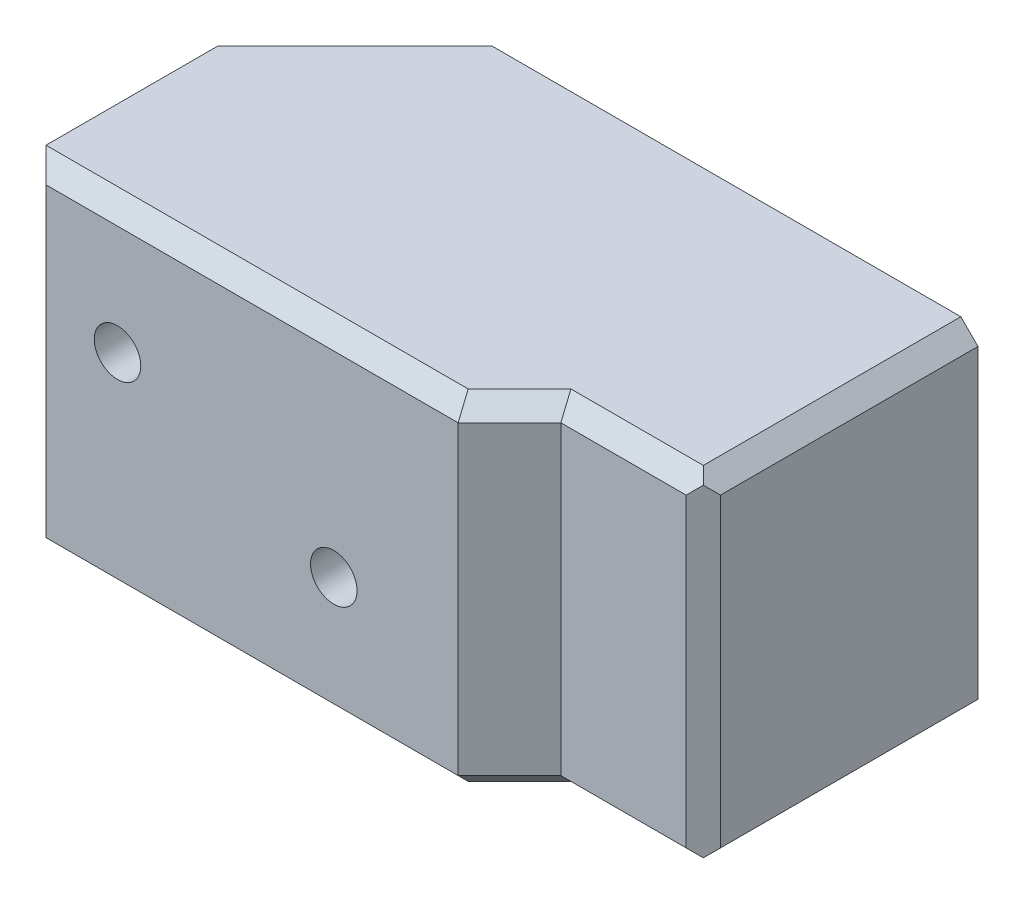
ISO-10303-21;
HEADER;
FILE_DESCRIPTION(('STEP AP214'),'2;1');
FILE_NAME('part.step','',(''),(''),'','','');
FILE_SCHEMA(('AUTOMOTIVE_DESIGN { 1 0 10303 214 1 1 1 1 }'));
ENDSEC;
DATA;
#1=APPLICATION_CONTEXT('core data for automotive mechanical design processes');
#2=APPLICATION_PROTOCOL_DEFINITION('international standard','automotive_design',2000,#1);
#3=PRODUCT_CONTEXT('',#1,'mechanical');
#4=PRODUCT('Part','Part','',(#3));
#5=PRODUCT_RELATED_PRODUCT_CATEGORY('part','',(#4));
#6=PRODUCT_DEFINITION_FORMATION('','',#4);
#7=PRODUCT_DEFINITION_CONTEXT('part definition',#1,'design');
#8=PRODUCT_DEFINITION('design','',#6,#7);
#9=PRODUCT_DEFINITION_SHAPE('','',#8);
#10=(LENGTH_UNIT() NAMED_UNIT(*) SI_UNIT(.MILLI.,.METRE.));
#11=(NAMED_UNIT(*) PLANE_ANGLE_UNIT() SI_UNIT($,.RADIAN.));
#12=(NAMED_UNIT(*) SI_UNIT($,.STERADIAN.) SOLID_ANGLE_UNIT());
#13=UNCERTAINTY_MEASURE_WITH_UNIT(LENGTH_MEASURE(1.E-05),#10,'distance_accuracy_value','');
#14=(GEOMETRIC_REPRESENTATION_CONTEXT(3) GLOBAL_UNCERTAINTY_ASSIGNED_CONTEXT((#13)) GLOBAL_UNIT_ASSIGNED_CONTEXT((#10,
#11,#12)) REPRESENTATION_CONTEXT('',''));
#15=CARTESIAN_POINT('',(0.,0.,0.));
#16=DIRECTION('',(0.,0.,1.));
#17=DIRECTION('',(1.,0.,0.));
#18=AXIS2_PLACEMENT_3D('',#15,#16,#17);
#19=CARTESIAN_POINT('',(0.,0.,7.9248));
#20=DIRECTION('',(0.,0.,-1.));
#21=DIRECTION('',(-1.,0.,0.));
#22=AXIS2_PLACEMENT_3D('',#19,#20,#21);
#23=PLANE('',#22);
#24=DIRECTION('',(0.,-1.,0.));
#25=VECTOR('',#24,1.);
#26=CARTESIAN_POINT('',(3.38750000000025,0.,7.9248));
#27=LINE('',#26,#25);
#28=CARTESIAN_POINT('',(3.38750000000025,22.7381495970976,7.9248));
#29=VERTEX_POINT('',#28);
#30=CARTESIAN_POINT('',(3.38750000000025,-5.51685040290261,7.9248));
#31=VERTEX_POINT('',#30);
#32=EDGE_CURVE('E331',#29,#31,#27,.T.);
#33=ORIENTED_EDGE('',*,*,#32,.T.);
#34=DIRECTION('',(1.,0.,0.));
#35=VECTOR('',#34,1.);
#36=CARTESIAN_POINT('',(41.5002000000004,-5.51685040290261,7.9248));
#37=LINE('',#36,#35);
#38=CARTESIAN_POINT('',(41.5002000000004,-5.51685040290261,7.9248));
#39=VERTEX_POINT('',#38);
#40=EDGE_CURVE('E333',#31,#39,#37,.T.);
#41=ORIENTED_EDGE('',*,*,#40,.T.);
#42=DIRECTION('',(0.,-1.,0.));
#43=VECTOR('',#42,1.);
#44=CARTESIAN_POINT('',(41.5002000000004,0.,7.9248));
#45=LINE('',#44,#43);
#46=CARTESIAN_POINT('',(41.5002000000004,22.7381495970976,7.9248));
#47=VERTEX_POINT('',#46);
#48=EDGE_CURVE('E305',#39,#47,#45,.F.);
#49=ORIENTED_EDGE('',*,*,#48,.T.);
#50=DIRECTION('',(-1.,0.,0.));
#51=VECTOR('',#50,1.);
#52=CARTESIAN_POINT('',(1.80000000000025,22.7381495970976,7.9248));
#53=LINE('',#52,#51);
#54=EDGE_CURVE('E329',#47,#29,#53,.T.);
#55=ORIENTED_EDGE('',*,*,#54,.T.);
#56=EDGE_LOOP('',(#33,#41,#49,#55));
#57=FACE_BOUND('',#56,.T.);
#58=CARTESIAN_POINT('',(30.0000000000003,4.61064959709748,7.9248));
#59=DIRECTION('',(0.,0.,1.));
#60=DIRECTION('',(1.,0.,0.));
#61=AXIS2_PLACEMENT_3D('',#58,#59,#60);
#62=CIRCLE('',#61,2.15265);
#63=CARTESIAN_POINT('',(32.1526500000003,4.61064959709748,7.9248));
#64=VERTEX_POINT('',#63);
#65=EDGE_CURVE('E398',#64,#64,#62,.T.);
#66=ORIENTED_EDGE('',*,*,#65,.F.);
#67=EDGE_LOOP('',(#66));
#68=FACE_BOUND('',#67,.T.);
#69=CARTESIAN_POINT('',(9.99999999999979,12.6106495970975,7.9248));
#70=DIRECTION('',(0.,0.,1.));
#71=DIRECTION('',(1.,0.,0.));
#72=AXIS2_PLACEMENT_3D('',#69,#70,#71);
#73=CIRCLE('',#72,2.15265);
#74=CARTESIAN_POINT('',(12.1526499999998,12.6106495970975,7.9248));
#75=VERTEX_POINT('',#74);
#76=EDGE_CURVE('E404',#75,#75,#73,.T.);
#77=ORIENTED_EDGE('',*,*,#76,.F.);
#78=EDGE_LOOP('',(#77));
#79=FACE_BOUND('',#78,.T.);
#80=ADVANCED_FACE('F35',(#57,#68,#79),#23,.F.);
#81=CARTESIAN_POINT('',(0.,0.,3.175));
#82=DIRECTION('',(0.,0.,-1.));
#83=DIRECTION('',(-1.,0.,0.));
#84=AXIS2_PLACEMENT_3D('',#81,#82,#83);
#85=PLANE('',#84);
#86=DIRECTION('',(0.,-1.,0.));
#87=VECTOR('',#86,1.);
#88=CARTESIAN_POINT('',(46.2500000000003,-7.10435040290261,3.175));
#89=LINE('',#88,#87);
#90=CARTESIAN_POINT('',(46.2500000000003,22.7381495970976,3.175));
#91=VERTEX_POINT('',#90);
#92=CARTESIAN_POINT('',(46.2500000000003,-5.51685040290261,3.175));
#93=VERTEX_POINT('',#92);
#94=EDGE_CURVE('E302',#91,#93,#89,.T.);
#95=ORIENTED_EDGE('',*,*,#94,.T.);
#96=DIRECTION('',(1.,0.,0.));
#97=VECTOR('',#96,1.);
#98=CARTESIAN_POINT('',(57.8375000000003,-5.51685040290261,3.175));
#99=LINE('',#98,#97);
#100=CARTESIAN_POINT('',(57.8375000000003,-5.51685040290261,3.175));
#101=VERTEX_POINT('',#100);
#102=EDGE_CURVE('E310',#93,#101,#99,.T.);
#103=ORIENTED_EDGE('',*,*,#102,.T.);
#104=DIRECTION('',(0.,1.,0.));
#105=VECTOR('',#104,1.);
#106=CARTESIAN_POINT('',(57.8375000000003,24.3256495970976,3.175));
#107=LINE('',#106,#105);
#108=CARTESIAN_POINT('',(57.8375000000003,22.7381495970976,3.175));
#109=VERTEX_POINT('',#108);
#110=EDGE_CURVE('E221',#101,#109,#107,.T.);
#111=ORIENTED_EDGE('',*,*,#110,.T.);
#112=DIRECTION('',(-1.,0.,0.));
#113=VECTOR('',#112,1.);
#114=CARTESIAN_POINT('',(46.2500000000003,22.7381495970976,3.175));
#115=LINE('',#114,#113);
#116=EDGE_CURVE('E308',#109,#91,#115,.T.);
#117=ORIENTED_EDGE('',*,*,#116,.T.);
#118=EDGE_LOOP('',(#95,#103,#111,#117));
#119=FACE_BOUND('',#118,.T.);
#120=ADVANCED_FACE('F412',(#119),#85,.F.);
#121=CARTESIAN_POINT('',(1.80000000000025,-1.3893504029026,3.175));
#122=DIRECTION('',(1.,0.,0.));
#123=DIRECTION('',(0.,0.,-1.));
#124=AXIS2_PLACEMENT_3D('',#121,#122,#123);
#125=PLANE('',#124);
#126=DIRECTION('',(0.,0.,1.));
#127=VECTOR('',#126,1.);
#128=CARTESIAN_POINT('',(1.80000000000025,-7.10435040290261,3.175));
#129=LINE('',#128,#127);
#130=CARTESIAN_POINT('',(1.80000000000025,-7.10435040290261,-9.525));
#131=VERTEX_POINT('',#130);
#132=CARTESIAN_POINT('',(1.80000000000025,-7.10435040290261,6.33730000000001));
#133=VERTEX_POINT('',#132);
#134=EDGE_CURVE('E389',#131,#133,#129,.T.);
#135=ORIENTED_EDGE('',*,*,#134,.T.);
#136=DIRECTION('',(0.,1.,0.));
#137=VECTOR('',#136,1.);
#138=CARTESIAN_POINT('',(1.80000000000025,-1.3893504029026,6.33730000000001));
#139=LINE('',#138,#137);
#140=CARTESIAN_POINT('',(1.80000000000025,24.3256495970976,6.33730000000001));
#141=VERTEX_POINT('',#140);
#142=EDGE_CURVE('E335',#133,#141,#139,.T.);
#143=ORIENTED_EDGE('',*,*,#142,.T.);
#144=DIRECTION('',(0.,0.,-1.));
#145=VECTOR('',#144,1.);
#146=CARTESIAN_POINT('',(1.80000000000025,24.3256495970976,3.175));
#147=LINE('',#146,#145);
#148=CARTESIAN_POINT('',(1.80000000000025,24.3256495970976,-9.525));
#149=VERTEX_POINT('',#148);
#150=EDGE_CURVE('E377',#141,#149,#147,.T.);
#151=ORIENTED_EDGE('',*,*,#150,.T.);
#152=DIRECTION('',(0.,-1.,0.));
#153=VECTOR('',#152,1.);
#154=CARTESIAN_POINT('',(1.80000000000025,21.1506495970976,-9.525));
#155=LINE('',#154,#153);
#156=CARTESIAN_POINT('',(1.80000000000025,21.1506495970976,-9.525));
#157=VERTEX_POINT('',#156);
#158=EDGE_CURVE('E286',#149,#157,#155,.T.);
#159=ORIENTED_EDGE('',*,*,#158,.T.);
#160=DIRECTION('',(0.,0.,1.));
#161=VECTOR('',#160,1.);
#162=CARTESIAN_POINT('',(1.80000000000025,21.1506495970976,0.));
#163=LINE('',#162,#161);
#164=CARTESIAN_POINT('',(1.80000000000025,21.1506495970976,-1.5875));
#165=VERTEX_POINT('',#164);
#166=EDGE_CURVE('E383',#157,#165,#163,.T.);
#167=ORIENTED_EDGE('',*,*,#166,.T.);
#168=DIRECTION('',(0.,0.707106781186551,-0.707106781186544));
#169=VECTOR('',#168,1.);
#170=CARTESIAN_POINT('',(1.80000000000025,7.4993995970974,12.0637500000001));
#171=LINE('',#170,#169);
#172=CARTESIAN_POINT('',(1.80000000000025,19.5631495970976,0.));
#173=VERTEX_POINT('',#172);
#174=EDGE_CURVE('E253',#165,#173,#171,.F.);
#175=ORIENTED_EDGE('',*,*,#174,.T.);
#176=DIRECTION('',(0.,-1.,0.));
#177=VECTOR('',#176,1.);
#178=CARTESIAN_POINT('',(1.80000000000025,-1.3893504029026,0.));
#179=LINE('',#178,#177);
#180=CARTESIAN_POINT('',(1.80000000000025,-2.34185040290259,0.));
#181=VERTEX_POINT('',#180);
#182=EDGE_CURVE('E201',#173,#181,#179,.T.);
#183=ORIENTED_EDGE('',*,*,#182,.T.);
#184=DIRECTION('',(0.,0.707106781186551,0.707106781186544));
#185=VECTOR('',#184,1.);
#186=CARTESIAN_POINT('',(1.80000000000025,-0.278100402902592,2.06374999999998));
#187=LINE('',#186,#185);
#188=CARTESIAN_POINT('',(1.80000000000025,-3.9293504029026,-1.5875));
#189=VERTEX_POINT('',#188);
#190=EDGE_CURVE('E255',#181,#189,#187,.F.);
#191=ORIENTED_EDGE('',*,*,#190,.T.);
#192=DIRECTION('',(0.,0.,-1.));
#193=VECTOR('',#192,1.);
#194=CARTESIAN_POINT('',(1.80000000000025,-3.9293504029026,0.));
#195=LINE('',#194,#193);
#196=CARTESIAN_POINT('',(1.80000000000025,-3.9293504029026,-9.525));
#197=VERTEX_POINT('',#196);
#198=EDGE_CURVE('E381',#189,#197,#195,.T.);
#199=ORIENTED_EDGE('',*,*,#198,.T.);
#200=DIRECTION('',(0.,-1.,0.));
#201=VECTOR('',#200,1.);
#202=CARTESIAN_POINT('',(1.80000000000025,-7.10435040290261,-9.525));
#203=LINE('',#202,#201);
#204=EDGE_CURVE('E262',#197,#131,#203,.T.);
#205=ORIENTED_EDGE('',*,*,#204,.T.);
#206=EDGE_LOOP('',(#135,#143,#151,#159,#167,#175,#183,#191,#199,#205));
#207=FACE_BOUND('',#206,.T.);
#208=ADVANCED_FACE('F418',(#207),#125,.F.);
#209=CARTESIAN_POINT('',(0.,0.,0.));
#210=DIRECTION('',(0.,0.,-1.));
#211=DIRECTION('',(-1.,0.,0.));
#212=AXIS2_PLACEMENT_3D('',#209,#210,#211);
#213=PLANE('',#212);
#214=CARTESIAN_POINT('',(9.99999999999979,12.6106495970975,0.));
#215=DIRECTION('',(0.,0.,-1.));
#216=DIRECTION('',(-1.,0.,0.));
#217=AXIS2_PLACEMENT_3D('',#214,#215,#216);
#218=CIRCLE('',#217,2.15265);
#219=CARTESIAN_POINT('',(7.84734999999979,12.6106495970975,0.));
#220=VERTEX_POINT('',#219);
#221=EDGE_CURVE('E401',#220,#220,#218,.T.);
#222=ORIENTED_EDGE('',*,*,#221,.F.);
#223=EDGE_LOOP('',(#222));
#224=FACE_BOUND('',#223,.T.);
#225=CARTESIAN_POINT('',(30.0000000000003,4.61064959709748,0.));
#226=DIRECTION('',(0.,0.,-1.));
#227=DIRECTION('',(-1.,0.,0.));
#228=AXIS2_PLACEMENT_3D('',#225,#226,#227);
#229=CIRCLE('',#228,2.15265);
#230=CARTESIAN_POINT('',(27.8473500000003,4.61064959709748,0.));
#231=VERTEX_POINT('',#230);
#232=EDGE_CURVE('E345',#231,#231,#229,.T.);
#233=ORIENTED_EDGE('',*,*,#232,.F.);
#234=EDGE_LOOP('',(#233));
#235=FACE_BOUND('',#234,.T.);
#236=ORIENTED_EDGE('',*,*,#182,.F.);
#237=DIRECTION('',(1.,0.,0.));
#238=VECTOR('',#237,1.);
#239=CARTESIAN_POINT('',(56.2500000000004,19.5631495970976,0.));
#240=LINE('',#239,#238);
#241=CARTESIAN_POINT('',(54.6625000000004,19.5631495970976,0.));
#242=VERTEX_POINT('',#241);
#243=EDGE_CURVE('E234',#173,#242,#240,.T.);
#244=ORIENTED_EDGE('',*,*,#243,.T.);
#245=DIRECTION('',(0.,-1.,0.));
#246=VECTOR('',#245,1.);
#247=CARTESIAN_POINT('',(54.6625000000004,0.,0.));
#248=LINE('',#247,#246);
#249=CARTESIAN_POINT('',(54.6625000000004,-2.34185040290259,0.));
#250=VERTEX_POINT('',#249);
#251=EDGE_CURVE('E230',#242,#250,#248,.T.);
#252=ORIENTED_EDGE('',*,*,#251,.T.);
#253=DIRECTION('',(-1.,0.,0.));
#254=VECTOR('',#253,1.);
#255=CARTESIAN_POINT('',(1.80000000000025,-2.34185040290259,0.));
#256=LINE('',#255,#254);
#257=EDGE_CURVE('E232',#250,#181,#256,.T.);
#258=ORIENTED_EDGE('',*,*,#257,.T.);
#259=EDGE_LOOP('',(#236,#244,#252,#258));
#260=FACE_BOUND('',#259,.T.);
#261=ADVANCED_FACE('F443',(#224,#235,#260),#213,.T.);
#262=CARTESIAN_POINT('',(-24.2349999999997,24.3256495970976,3.175));
#263=DIRECTION('',(0.,1.,0.));
#264=DIRECTION('',(0.,0.,1.));
#265=AXIS2_PLACEMENT_3D('',#262,#263,#264);
#266=PLANE('',#265);
#267=ORIENTED_EDGE('',*,*,#150,.F.);
#268=DIRECTION('',(1.,0.,0.));
#269=VECTOR('',#268,1.);
#270=CARTESIAN_POINT('',(41.5002000000004,24.3256495970976,6.33730000000001));
#271=LINE('',#270,#269);
#272=CARTESIAN_POINT('',(40.8426359697331,24.3256495970976,6.33730000000001));
#273=VERTEX_POINT('',#272);
#274=EDGE_CURVE('E44',#141,#273,#271,.T.);
#275=ORIENTED_EDGE('',*,*,#274,.T.);
#276=DIRECTION('',(0.707106781186544,0.,-0.707106781186551));
#277=VECTOR('',#276,1.);
#278=CARTESIAN_POINT('',(45.1274679848667,24.3256495970976,2.05246798486636));
#279=LINE('',#278,#277);
#280=CARTESIAN_POINT('',(45.592435969733,24.3256495970976,1.58750000000001));
#281=VERTEX_POINT('',#280);
#282=EDGE_CURVE('E55',#273,#281,#279,.T.);
#283=ORIENTED_EDGE('',*,*,#282,.T.);
#284=DIRECTION('',(1.,0.,0.));
#285=VECTOR('',#284,1.);
#286=CARTESIAN_POINT('',(57.8375000000003,24.3256495970976,1.58750000000001));
#287=LINE('',#286,#285);
#288=CARTESIAN_POINT('',(57.8375000000003,24.3256495970976,1.58750000000001));
#289=VERTEX_POINT('',#288);
#290=EDGE_CURVE('E337',#281,#289,#287,.T.);
#291=ORIENTED_EDGE('',*,*,#290,.T.);
#292=DIRECTION('',(0.,0.,-1.));
#293=VECTOR('',#292,1.);
#294=CARTESIAN_POINT('',(57.8375000000003,24.3256495970976,3.175));
#295=LINE('',#294,#293);
#296=CARTESIAN_POINT('',(57.8375000000003,24.3256495970976,-22.225));
#297=VERTEX_POINT('',#296);
#298=EDGE_CURVE('E219',#289,#297,#295,.T.);
#299=ORIENTED_EDGE('',*,*,#298,.T.);
#300=DIRECTION('',(1.,0.,0.));
#301=VECTOR('',#300,1.);
#302=CARTESIAN_POINT('',(-24.2349999999997,24.3256495970976,-22.225));
#303=LINE('',#302,#301);
#304=CARTESIAN_POINT('',(14.5000000000003,24.3256495970976,-22.225));
#305=VERTEX_POINT('',#304);
#306=EDGE_CURVE('E380',#305,#297,#303,.T.);
#307=ORIENTED_EDGE('',*,*,#306,.F.);
#308=DIRECTION('',(-0.707106781186549,0.,0.707106781186546));
#309=VECTOR('',#308,1.);
#310=CARTESIAN_POINT('',(-17.5674999999998,24.3256495970976,9.84249999999997));
#311=LINE('',#310,#309);
#312=EDGE_CURVE('E295',#305,#149,#311,.T.);
#313=ORIENTED_EDGE('',*,*,#312,.T.);
#314=EDGE_LOOP('',(#267,#275,#283,#291,#299,#307,#313));
#315=FACE_BOUND('',#314,.T.);
#316=ADVANCED_FACE('F368',(#315),#266,.T.);
#317=CARTESIAN_POINT('',(-24.2349999999997,21.1506495970976,-22.225));
#318=DIRECTION('',(0.,0.,-1.));
#319=DIRECTION('',(-1.,0.,0.));
#320=AXIS2_PLACEMENT_3D('',#317,#318,#319);
#321=PLANE('',#320);
#322=DIRECTION('',(1.,0.,0.));
#323=VECTOR('',#322,1.);
#324=CARTESIAN_POINT('',(-24.2349999999997,21.1506495970976,-22.225));
#325=LINE('',#324,#323);
#326=CARTESIAN_POINT('',(14.5000000000003,21.1506495970976,-22.225));
#327=VERTEX_POINT('',#326);
#328=CARTESIAN_POINT('',(54.6625000000003,21.1506495970976,-22.225));
#329=VERTEX_POINT('',#328);
#330=EDGE_CURVE('E378',#327,#329,#325,.T.);
#331=ORIENTED_EDGE('',*,*,#330,.F.);
#332=DIRECTION('',(0.,1.,0.));
#333=VECTOR('',#332,1.);
#334=CARTESIAN_POINT('',(14.5000000000003,24.3256495970976,-22.225));
#335=LINE('',#334,#333);
#336=EDGE_CURVE('E293',#327,#305,#335,.T.);
#337=ORIENTED_EDGE('',*,*,#336,.T.);
#338=ORIENTED_EDGE('',*,*,#306,.T.);
#339=DIRECTION('',(-0.707106781186549,0.707106781186546,0.));
#340=VECTOR('',#339,1.);
#341=CARTESIAN_POINT('',(18.3887500000001,63.7743995970977,-22.225));
#342=LINE('',#341,#340);
#343=CARTESIAN_POINT('',(59.4250000000004,22.7381495970976,-22.225));
#344=VERTEX_POINT('',#343);
#345=EDGE_CURVE('E212',#297,#344,#342,.F.);
#346=ORIENTED_EDGE('',*,*,#345,.T.);
#347=DIRECTION('',(0.,1.,0.));
#348=VECTOR('',#347,1.);
#349=CARTESIAN_POINT('',(59.4250000000004,24.3256495970976,-22.225));
#350=LINE('',#349,#348);
#351=CARTESIAN_POINT('',(59.4250000000004,-5.51685040290261,-22.225));
#352=VERTEX_POINT('',#351);
#353=EDGE_CURVE('E194',#352,#344,#350,.T.);
#354=ORIENTED_EDGE('',*,*,#353,.F.);
#355=DIRECTION('',(0.707106781186549,0.707106781186546,0.));
#356=VECTOR('',#355,1.);
#357=CARTESIAN_POINT('',(30.9287500000002,-34.0131004029026,-22.225));
#358=LINE('',#357,#356);
#359=CARTESIAN_POINT('',(57.8375000000003,-7.10435040290261,-22.225));
#360=VERTEX_POINT('',#359);
#361=EDGE_CURVE('E208',#352,#360,#358,.F.);
#362=ORIENTED_EDGE('',*,*,#361,.T.);
#363=DIRECTION('',(1.,0.,0.));
#364=VECTOR('',#363,1.);
#365=CARTESIAN_POINT('',(-24.2349999999997,-7.10435040290261,-22.225));
#366=LINE('',#365,#364);
#367=CARTESIAN_POINT('',(14.5000000000003,-7.10435040290261,-22.225));
#368=VERTEX_POINT('',#367);
#369=EDGE_CURVE('E213',#368,#360,#366,.T.);
#370=ORIENTED_EDGE('',*,*,#369,.F.);
#371=DIRECTION('',(0.,1.,0.));
#372=VECTOR('',#371,1.);
#373=CARTESIAN_POINT('',(14.5000000000003,-3.9293504029026,-22.225));
#374=LINE('',#373,#372);
#375=CARTESIAN_POINT('',(14.5000000000003,-3.9293504029026,-22.225));
#376=VERTEX_POINT('',#375);
#377=EDGE_CURVE('E291',#368,#376,#374,.T.);
#378=ORIENTED_EDGE('',*,*,#377,.T.);
#379=DIRECTION('',(1.,0.,0.));
#380=VECTOR('',#379,1.);
#381=CARTESIAN_POINT('',(-24.2349999999997,-3.9293504029026,-22.225));
#382=LINE('',#381,#380);
#383=CARTESIAN_POINT('',(54.6625000000003,-3.9293504029026,-22.225));
#384=VERTEX_POINT('',#383);
#385=EDGE_CURVE('E387',#376,#384,#382,.T.);
#386=ORIENTED_EDGE('',*,*,#385,.T.);
#387=DIRECTION('',(0.707106781186546,0.707106781186549,0.));
#388=VECTOR('',#387,1.);
#389=CARTESIAN_POINT('',(56.2500000000004,-2.34185040290259,-22.225));
#390=LINE('',#389,#388);
#391=CARTESIAN_POINT('',(56.2500000000004,-2.34185040290259,-22.225));
#392=VERTEX_POINT('',#391);
#393=EDGE_CURVE('E260',#384,#392,#390,.T.);
#394=ORIENTED_EDGE('',*,*,#393,.T.);
#395=DIRECTION('',(0.,1.,0.));
#396=VECTOR('',#395,1.);
#397=CARTESIAN_POINT('',(56.2500000000004,24.3256495970976,-22.225));
#398=LINE('',#397,#396);
#399=CARTESIAN_POINT('',(56.2500000000004,19.5631495970976,-22.225));
#400=VERTEX_POINT('',#399);
#401=EDGE_CURVE('E214',#392,#400,#398,.T.);
#402=ORIENTED_EDGE('',*,*,#401,.T.);
#403=DIRECTION('',(-0.707106781186546,0.707106781186549,0.));
#404=VECTOR('',#403,1.);
#405=CARTESIAN_POINT('',(56.2500000000004,19.5631495970976,-22.225));
#406=LINE('',#405,#404);
#407=EDGE_CURVE('E257',#400,#329,#406,.T.);
#408=ORIENTED_EDGE('',*,*,#407,.T.);
#409=EDGE_LOOP('',(#331,#337,#338,#346,#354,#362,#370,#378,#386,#394,#402,#408));
#410=FACE_BOUND('',#409,.T.);
#411=ADVANCED_FACE('F206',(#410),#321,.T.);
#412=CARTESIAN_POINT('',(-24.2349999999997,21.1506495970976,0.));
#413=DIRECTION('',(0.,-1.,0.));
#414=DIRECTION('',(0.,0.,-1.));
#415=AXIS2_PLACEMENT_3D('',#412,#413,#414);
#416=PLANE('',#415);
#417=ORIENTED_EDGE('',*,*,#166,.F.);
#418=DIRECTION('',(0.707106781186549,0.,-0.707106781186546));
#419=VECTOR('',#418,1.);
#420=CARTESIAN_POINT('',(-15.9799999999998,21.1506495970976,8.25499999999998));
#421=LINE('',#420,#419);
#422=EDGE_CURVE('E289',#157,#327,#421,.T.);
#423=ORIENTED_EDGE('',*,*,#422,.T.);
#424=ORIENTED_EDGE('',*,*,#330,.T.);
#425=DIRECTION('',(0.,0.,1.));
#426=VECTOR('',#425,1.);
#427=CARTESIAN_POINT('',(54.6625000000003,21.1506495970976,0.));
#428=LINE('',#427,#426);
#429=CARTESIAN_POINT('',(54.6625000000003,21.1506495970976,-1.5875));
#430=VERTEX_POINT('',#429);
#431=EDGE_CURVE('E237',#329,#430,#428,.T.);
#432=ORIENTED_EDGE('',*,*,#431,.T.);
#433=DIRECTION('',(-1.,0.,0.));
#434=VECTOR('',#433,1.);
#435=CARTESIAN_POINT('',(1.80000000000025,21.1506495970976,-1.5875));
#436=LINE('',#435,#434);
#437=EDGE_CURVE('E239',#430,#165,#436,.T.);
#438=ORIENTED_EDGE('',*,*,#437,.T.);
#439=EDGE_LOOP('',(#417,#423,#424,#432,#438));
#440=FACE_BOUND('',#439,.T.);
#441=ADVANCED_FACE('F436',(#440),#416,.T.);
#442=CARTESIAN_POINT('',(-24.2349999999997,-3.9293504029026,0.));
#443=DIRECTION('',(0.,1.,0.));
#444=DIRECTION('',(0.,0.,1.));
#445=AXIS2_PLACEMENT_3D('',#442,#443,#444);
#446=PLANE('',#445);
#447=ORIENTED_EDGE('',*,*,#385,.F.);
#448=DIRECTION('',(-0.707106781186549,0.,0.707106781186546));
#449=VECTOR('',#448,1.);
#450=CARTESIAN_POINT('',(-15.9799999999998,-3.9293504029026,8.25499999999998));
#451=LINE('',#450,#449);
#452=EDGE_CURVE('E300',#376,#197,#451,.T.);
#453=ORIENTED_EDGE('',*,*,#452,.T.);
#454=ORIENTED_EDGE('',*,*,#198,.F.);
#455=DIRECTION('',(1.,0.,0.));
#456=VECTOR('',#455,1.);
#457=CARTESIAN_POINT('',(56.2500000000004,-3.9293504029026,-1.5875));
#458=LINE('',#457,#456);
#459=CARTESIAN_POINT('',(54.6625000000003,-3.9293504029026,-1.5875));
#460=VERTEX_POINT('',#459);
#461=EDGE_CURVE('E245',#189,#460,#458,.T.);
#462=ORIENTED_EDGE('',*,*,#461,.T.);
#463=DIRECTION('',(0.,0.,-1.));
#464=VECTOR('',#463,1.);
#465=CARTESIAN_POINT('',(54.6625000000003,-3.9293504029026,0.));
#466=LINE('',#465,#464);
#467=EDGE_CURVE('E242',#460,#384,#466,.T.);
#468=ORIENTED_EDGE('',*,*,#467,.T.);
#469=EDGE_LOOP('',(#447,#453,#454,#462,#468));
#470=FACE_BOUND('',#469,.T.);
#471=ADVANCED_FACE('F433',(#470),#446,.T.);
#472=CARTESIAN_POINT('',(-24.2349999999997,-7.10435040290261,3.175));
#473=DIRECTION('',(0.,-1.,0.));
#474=DIRECTION('',(0.,0.,-1.));
#475=AXIS2_PLACEMENT_3D('',#472,#473,#474);
#476=PLANE('',#475);
#477=DIRECTION('',(0.,0.,1.));
#478=VECTOR('',#477,1.);
#479=CARTESIAN_POINT('',(57.8375000000003,-7.10435040290261,3.175));
#480=LINE('',#479,#478);
#481=CARTESIAN_POINT('',(57.8375000000003,-7.10435040290261,1.58750000000001));
#482=VERTEX_POINT('',#481);
#483=EDGE_CURVE('E218',#360,#482,#480,.T.);
#484=ORIENTED_EDGE('',*,*,#483,.T.);
#485=DIRECTION('',(-1.,0.,0.));
#486=VECTOR('',#485,1.);
#487=CARTESIAN_POINT('',(46.2500000000003,-7.10435040290261,1.58750000000001));
#488=LINE('',#487,#486);
#489=CARTESIAN_POINT('',(45.592435969733,-7.10435040290261,1.58750000000001));
#490=VERTEX_POINT('',#489);
#491=EDGE_CURVE('E323',#482,#490,#488,.T.);
#492=ORIENTED_EDGE('',*,*,#491,.T.);
#493=DIRECTION('',(-0.707106781186544,0.,0.707106781186551));
#494=VECTOR('',#493,1.);
#495=CARTESIAN_POINT('',(40.3776679848667,-7.10435040290261,6.80226798486636));
#496=LINE('',#495,#494);
#497=CARTESIAN_POINT('',(40.8426359697331,-7.10435040290261,6.33730000000001));
#498=VERTEX_POINT('',#497);
#499=EDGE_CURVE('E321',#490,#498,#496,.T.);
#500=ORIENTED_EDGE('',*,*,#499,.T.);
#501=DIRECTION('',(-1.,0.,0.));
#502=VECTOR('',#501,1.);
#503=CARTESIAN_POINT('',(1.80000000000025,-7.10435040290261,6.33730000000001));
#504=LINE('',#503,#502);
#505=EDGE_CURVE('E319',#498,#133,#504,.T.);
#506=ORIENTED_EDGE('',*,*,#505,.T.);
#507=ORIENTED_EDGE('',*,*,#134,.F.);
#508=DIRECTION('',(0.707106781186549,0.,-0.707106781186546));
#509=VECTOR('',#508,1.);
#510=CARTESIAN_POINT('',(-17.5674999999998,-7.10435040290261,9.84249999999997));
#511=LINE('',#510,#509);
#512=EDGE_CURVE('E298',#131,#368,#511,.T.);
#513=ORIENTED_EDGE('',*,*,#512,.T.);
#514=ORIENTED_EDGE('',*,*,#369,.T.);
#515=EDGE_LOOP('',(#484,#492,#500,#506,#507,#513,#514));
#516=FACE_BOUND('',#515,.T.);
#517=ADVANCED_FACE('F431',(#516),#476,.T.);
#518=CARTESIAN_POINT('',(56.2500000000004,0.,0.));
#519=DIRECTION('',(1.,0.,0.));
#520=DIRECTION('',(0.,0.,-1.));
#521=AXIS2_PLACEMENT_3D('',#518,#519,#520);
#522=PLANE('',#521);
#523=DIRECTION('',(0.,1.,0.));
#524=VECTOR('',#523,1.);
#525=CARTESIAN_POINT('',(56.2500000000004,0.,-1.58750000000001));
#526=LINE('',#525,#524);
#527=CARTESIAN_POINT('',(56.2500000000004,-2.34185040290259,-1.58750000000001));
#528=VERTEX_POINT('',#527);
#529=CARTESIAN_POINT('',(56.2500000000004,19.5631495970976,-1.58750000000001));
#530=VERTEX_POINT('',#529);
#531=EDGE_CURVE('E249',#528,#530,#526,.T.);
#532=ORIENTED_EDGE('',*,*,#531,.T.);
#533=DIRECTION('',(0.,0.,-1.));
#534=VECTOR('',#533,1.);
#535=CARTESIAN_POINT('',(56.2500000000004,19.5631495970976,0.));
#536=LINE('',#535,#534);
#537=EDGE_CURVE('E251',#530,#400,#536,.T.);
#538=ORIENTED_EDGE('',*,*,#537,.T.);
#539=ORIENTED_EDGE('',*,*,#401,.F.);
#540=DIRECTION('',(0.,0.,1.));
#541=VECTOR('',#540,1.);
#542=CARTESIAN_POINT('',(56.2500000000004,-2.34185040290259,0.));
#543=LINE('',#542,#541);
#544=EDGE_CURVE('E247',#392,#528,#543,.T.);
#545=ORIENTED_EDGE('',*,*,#544,.T.);
#546=EDGE_LOOP('',(#532,#538,#539,#545));
#547=FACE_BOUND('',#546,.T.);
#548=ADVANCED_FACE('F428',(#547),#522,.F.);
#549=CARTESIAN_POINT('',(59.4250000000004,0.,0.));
#550=DIRECTION('',(1.,0.,0.));
#551=DIRECTION('',(0.,0.,-1.));
#552=AXIS2_PLACEMENT_3D('',#549,#550,#551);
#553=PLANE('',#552);
#554=ORIENTED_EDGE('',*,*,#353,.T.);
#555=DIRECTION('',(0.,0.,1.));
#556=VECTOR('',#555,1.);
#557=CARTESIAN_POINT('',(59.4250000000004,22.7381495970976,0.));
#558=LINE('',#557,#556);
#559=CARTESIAN_POINT('',(59.4250000000004,22.7381495970976,1.5875));
#560=VERTEX_POINT('',#559);
#561=EDGE_CURVE('E223',#344,#560,#558,.T.);
#562=ORIENTED_EDGE('',*,*,#561,.T.);
#563=DIRECTION('',(0.,-1.,0.));
#564=VECTOR('',#563,1.);
#565=CARTESIAN_POINT('',(59.4250000000004,-7.10435040290261,1.5875));
#566=LINE('',#565,#564);
#567=CARTESIAN_POINT('',(59.4250000000004,-5.51685040290261,1.5875));
#568=VERTEX_POINT('',#567);
#569=EDGE_CURVE('E197',#560,#568,#566,.T.);
#570=ORIENTED_EDGE('',*,*,#569,.T.);
#571=DIRECTION('',(0.,0.,-1.));
#572=VECTOR('',#571,1.);
#573=CARTESIAN_POINT('',(59.4250000000004,-5.51685040290261,0.));
#574=LINE('',#573,#572);
#575=EDGE_CURVE('E190',#568,#352,#574,.T.);
#576=ORIENTED_EDGE('',*,*,#575,.T.);
#577=EDGE_LOOP('',(#554,#562,#570,#576));
#578=FACE_BOUND('',#577,.T.);
#579=ADVANCED_FACE('F192',(#578),#553,.T.);
#580=CARTESIAN_POINT('',(59.4250000000004,-5.51685040290261,0.));
#581=DIRECTION('',(-0.707106781186546,0.707106781186549,0.));
#582=DIRECTION('',(0.,0.,-1.));
#583=AXIS2_PLACEMENT_3D('',#580,#581,#582);
#584=PLANE('',#583);
#585=DIRECTION('',(0.577350269189628,0.577350269189625,-0.577350269189625));
#586=VECTOR('',#585,1.);
#587=CARTESIAN_POINT('',(59.954166666667,-4.98768373623594,1.05833333333334));
#588=LINE('',#587,#586);
#589=CARTESIAN_POINT('',(58.6312500000003,-6.31060040290261,2.38125));
#590=VERTEX_POINT('',#589);
#591=EDGE_CURVE('E265',#590,#568,#588,.T.);
#592=ORIENTED_EDGE('',*,*,#591,.F.);
#593=DIRECTION('',(0.577350269189628,0.577350269189626,0.577350269189623));
#594=VECTOR('',#593,1.);
#595=CARTESIAN_POINT('',(58.366666666667,-6.57518373623594,2.11666666666668));
#596=LINE('',#595,#594);
#597=EDGE_CURVE('E317',#590,#482,#596,.F.);
#598=ORIENTED_EDGE('',*,*,#597,.T.);
#599=ORIENTED_EDGE('',*,*,#483,.F.);
#600=ORIENTED_EDGE('',*,*,#361,.F.);
#601=ORIENTED_EDGE('',*,*,#575,.F.);
#602=EDGE_LOOP('',(#592,#598,#599,#600,#601));
#603=FACE_BOUND('',#602,.T.);
#604=ADVANCED_FACE('F216',(#603),#584,.F.);
#605=CARTESIAN_POINT('',(59.4250000000004,0.,1.5875));
#606=DIRECTION('',(0.707106781186546,0.,0.707106781186549));
#607=DIRECTION('',(0.,1.,0.));
#608=AXIS2_PLACEMENT_3D('',#605,#606,#607);
#609=PLANE('',#608);
#610=ORIENTED_EDGE('',*,*,#110,.F.);
#611=DIRECTION('',(0.577350269189627,-0.577350269189627,-0.577350269189624));
#612=VECTOR('',#611,1.);
#613=CARTESIAN_POINT('',(57.0568831990328,-4.73623360193507,3.95561680096754));
#614=LINE('',#613,#612);
#615=EDGE_CURVE('E315',#101,#590,#614,.T.);
#616=ORIENTED_EDGE('',*,*,#615,.T.);
#617=ORIENTED_EDGE('',*,*,#591,.T.);
#618=ORIENTED_EDGE('',*,*,#569,.F.);
#619=DIRECTION('',(0.577350269189628,-0.577350269189625,-0.577350269189625));
#620=VECTOR('',#619,1.);
#621=CARTESIAN_POINT('',(67.0043831990329,15.1587663980651,-5.99188319903251));
#622=LINE('',#621,#620);
#623=CARTESIAN_POINT('',(58.6312500000004,23.5318995970976,2.38125));
#624=VERTEX_POINT('',#623);
#625=EDGE_CURVE('E263',#624,#560,#622,.T.);
#626=ORIENTED_EDGE('',*,*,#625,.F.);
#627=DIRECTION('',(-0.577350269189627,-0.577350269189627,0.577350269189624));
#628=VECTOR('',#627,1.);
#629=CARTESIAN_POINT('',(51.3164501343011,16.2170997313984,9.69604986569919));
#630=LINE('',#629,#628);
#631=EDGE_CURVE('E313',#624,#109,#630,.T.);
#632=ORIENTED_EDGE('',*,*,#631,.T.);
#633=EDGE_LOOP('',(#610,#616,#617,#618,#626,#632));
#634=FACE_BOUND('',#633,.T.);
#635=ADVANCED_FACE('F458',(#634),#609,.T.);
#636=CARTESIAN_POINT('',(59.4250000000004,22.7381495970976,0.));
#637=DIRECTION('',(-0.707106781186546,-0.707106781186549,0.));
#638=DIRECTION('',(0.,0.,1.));
#639=AXIS2_PLACEMENT_3D('',#636,#637,#638);
#640=PLANE('',#639);
#641=ORIENTED_EDGE('',*,*,#298,.F.);
#642=DIRECTION('',(-0.577350269189628,0.577350269189626,-0.577350269189623));
#643=VECTOR('',#642,1.);
#644=CARTESIAN_POINT('',(58.366666666667,23.7964829304309,2.11666666666668));
#645=LINE('',#644,#643);
#646=EDGE_CURVE('E12',#289,#624,#645,.F.);
#647=ORIENTED_EDGE('',*,*,#646,.T.);
#648=ORIENTED_EDGE('',*,*,#625,.T.);
#649=ORIENTED_EDGE('',*,*,#561,.F.);
#650=ORIENTED_EDGE('',*,*,#345,.F.);
#651=EDGE_LOOP('',(#641,#647,#648,#649,#650));
#652=FACE_BOUND('',#651,.T.);
#653=ADVANCED_FACE('F371',(#652),#640,.F.);
#654=CARTESIAN_POINT('',(-24.2349999999997,-3.9293504029026,-1.5875));
#655=DIRECTION('',(0.,0.707106781186544,-0.707106781186551));
#656=DIRECTION('',(-1.,0.,0.));
#657=AXIS2_PLACEMENT_3D('',#654,#655,#656);
#658=PLANE('',#657);
#659=ORIENTED_EDGE('',*,*,#190,.F.);
#660=ORIENTED_EDGE('',*,*,#257,.F.);
#661=DIRECTION('',(0.,-0.707106781186551,-0.707106781186544));
#662=VECTOR('',#661,1.);
#663=CARTESIAN_POINT('',(54.6625000000003,-3.9293504029026,-1.5875));
#664=LINE('',#663,#662);
#665=EDGE_CURVE('E266',#460,#250,#664,.F.);
#666=ORIENTED_EDGE('',*,*,#665,.F.);
#667=ORIENTED_EDGE('',*,*,#461,.F.);
#668=EDGE_LOOP('',(#659,#660,#666,#667));
#669=FACE_BOUND('',#668,.T.);
#670=ADVANCED_FACE('F457',(#669),#658,.T.);
#671=CARTESIAN_POINT('',(56.2500000000004,-2.34185040290259,0.));
#672=DIRECTION('',(0.707106781186549,-0.707106781186546,0.));
#673=DIRECTION('',(0.,0.,1.));
#674=AXIS2_PLACEMENT_3D('',#671,#672,#673);
#675=PLANE('',#674);
#676=ORIENTED_EDGE('',*,*,#393,.F.);
#677=ORIENTED_EDGE('',*,*,#467,.F.);
#678=DIRECTION('',(-0.707106781186546,-0.707106781186549,0.));
#679=VECTOR('',#678,1.);
#680=CARTESIAN_POINT('',(54.6625000000003,-3.9293504029026,-1.5875));
#681=LINE('',#680,#679);
#682=EDGE_CURVE('E279',#528,#460,#681,.T.);
#683=ORIENTED_EDGE('',*,*,#682,.F.);
#684=ORIENTED_EDGE('',*,*,#544,.F.);
#685=EDGE_LOOP('',(#676,#677,#683,#684));
#686=FACE_BOUND('',#685,.T.);
#687=ADVANCED_FACE('F484',(#686),#675,.F.);
#688=CARTESIAN_POINT('',(54.6625000000003,-3.9293504029026,-1.5875));
#689=DIRECTION('',(-0.57735026918963,0.577350269189622,-0.577350269189625));
#690=DIRECTION('',(-0.707106781186545,0.,0.707106781186551));
#691=AXIS2_PLACEMENT_3D('',#688,#689,#690);
#692=PLANE('',#691);
#693=ORIENTED_EDGE('',*,*,#682,.T.);
#694=ORIENTED_EDGE('',*,*,#665,.T.);
#695=DIRECTION('',(0.707106781186544,0.,-0.707106781186551));
#696=VECTOR('',#695,1.);
#697=CARTESIAN_POINT('',(55.4562500000004,-2.34185040290259,-0.793750000000003));
#698=LINE('',#697,#696);
#699=EDGE_CURVE('E276',#528,#250,#698,.F.);
#700=ORIENTED_EDGE('',*,*,#699,.F.);
#701=EDGE_LOOP('',(#693,#694,#700));
#702=FACE_BOUND('',#701,.T.);
#703=ADVANCED_FACE('F480',(#702),#692,.T.);
#704=CARTESIAN_POINT('',(56.2500000000004,0.,-1.58750000000001));
#705=DIRECTION('',(0.707106781186551,0.,0.707106781186544));
#706=DIRECTION('',(0.,1.,0.));
#707=AXIS2_PLACEMENT_3D('',#704,#705,#706);
#708=PLANE('',#707);
#709=ORIENTED_EDGE('',*,*,#699,.T.);
#710=ORIENTED_EDGE('',*,*,#251,.F.);
#711=DIRECTION('',(-0.707106781186544,0.,0.707106781186551));
#712=VECTOR('',#711,1.);
#713=CARTESIAN_POINT('',(54.6625000000004,19.5631495970976,0.));
#714=LINE('',#713,#712);
#715=EDGE_CURVE('E273',#530,#242,#714,.T.);
#716=ORIENTED_EDGE('',*,*,#715,.F.);
#717=ORIENTED_EDGE('',*,*,#531,.F.);
#718=EDGE_LOOP('',(#709,#710,#716,#717));
#719=FACE_BOUND('',#718,.T.);
#720=ADVANCED_FACE('F476',(#719),#708,.F.);
#721=CARTESIAN_POINT('',(56.2500000000004,19.5631495970976,0.));
#722=DIRECTION('',(0.707106781186549,0.707106781186546,0.));
#723=DIRECTION('',(0.,0.,-1.));
#724=AXIS2_PLACEMENT_3D('',#721,#722,#723);
#725=PLANE('',#724);
#726=ORIENTED_EDGE('',*,*,#407,.F.);
#727=ORIENTED_EDGE('',*,*,#537,.F.);
#728=DIRECTION('',(0.707106781186546,-0.707106781186549,0.));
#729=VECTOR('',#728,1.);
#730=CARTESIAN_POINT('',(55.4562500000004,20.3568995970976,-1.58750000000001));
#731=LINE('',#730,#729);
#732=EDGE_CURVE('E270',#430,#530,#731,.T.);
#733=ORIENTED_EDGE('',*,*,#732,.F.);
#734=ORIENTED_EDGE('',*,*,#431,.F.);
#735=EDGE_LOOP('',(#726,#727,#733,#734));
#736=FACE_BOUND('',#735,.T.);
#737=ADVANCED_FACE('F472',(#736),#725,.F.);
#738=CARTESIAN_POINT('',(54.6625000000004,19.5631495970976,0.));
#739=DIRECTION('',(-0.57735026918963,-0.577350269189622,-0.577350269189625));
#740=DIRECTION('',(-0.707106781186545,0.,0.707106781186551));
#741=AXIS2_PLACEMENT_3D('',#738,#739,#740);
#742=PLANE('',#741);
#743=ORIENTED_EDGE('',*,*,#732,.T.);
#744=ORIENTED_EDGE('',*,*,#715,.T.);
#745=DIRECTION('',(0.,-0.707106781186551,0.707106781186545));
#746=VECTOR('',#745,1.);
#747=CARTESIAN_POINT('',(54.6625000000004,19.5631495970976,0.));
#748=LINE('',#747,#746);
#749=EDGE_CURVE('E268',#430,#242,#748,.T.);
#750=ORIENTED_EDGE('',*,*,#749,.F.);
#751=EDGE_LOOP('',(#743,#744,#750));
#752=FACE_BOUND('',#751,.T.);
#753=ADVANCED_FACE('F468',(#752),#742,.T.);
#754=CARTESIAN_POINT('',(0.,19.5631495970976,0.));
#755=DIRECTION('',(0.,-0.707106781186544,-0.707106781186551));
#756=DIRECTION('',(-1.,0.,0.));
#757=AXIS2_PLACEMENT_3D('',#754,#755,#756);
#758=PLANE('',#757);
#759=ORIENTED_EDGE('',*,*,#174,.F.);
#760=ORIENTED_EDGE('',*,*,#437,.F.);
#761=ORIENTED_EDGE('',*,*,#749,.T.);
#762=ORIENTED_EDGE('',*,*,#243,.F.);
#763=EDGE_LOOP('',(#759,#760,#761,#762));
#764=FACE_BOUND('',#763,.T.);
#765=ADVANCED_FACE('F464',(#764),#758,.T.);
#766=CARTESIAN_POINT('',(1.80000000000025,-1.3893504029026,-9.525));
#767=DIRECTION('',(-0.707106781186546,0.,-0.707106781186549));
#768=DIRECTION('',(0.,1.,0.));
#769=AXIS2_PLACEMENT_3D('',#766,#767,#768);
#770=PLANE('',#769);
#771=ORIENTED_EDGE('',*,*,#312,.F.);
#772=ORIENTED_EDGE('',*,*,#336,.F.);
#773=ORIENTED_EDGE('',*,*,#422,.F.);
#774=ORIENTED_EDGE('',*,*,#158,.F.);
#775=EDGE_LOOP('',(#771,#772,#773,#774));
#776=FACE_BOUND('',#775,.T.);
#777=ADVANCED_FACE('F467',(#776),#770,.T.);
#778=CARTESIAN_POINT('',(1.80000000000025,-1.3893504029026,-9.525));
#779=DIRECTION('',(-0.707106781186546,0.,-0.707106781186549));
#780=DIRECTION('',(0.,1.,0.));
#781=AXIS2_PLACEMENT_3D('',#778,#779,#780);
#782=PLANE('',#781);
#783=ORIENTED_EDGE('',*,*,#452,.F.);
#784=ORIENTED_EDGE('',*,*,#377,.F.);
#785=ORIENTED_EDGE('',*,*,#512,.F.);
#786=ORIENTED_EDGE('',*,*,#204,.F.);
#787=EDGE_LOOP('',(#783,#784,#785,#786));
#788=FACE_BOUND('',#787,.T.);
#789=ADVANCED_FACE('F494',(#788),#782,.T.);
#790=CARTESIAN_POINT('',(33.5500000000003,24.3256495970976,15.8750000000002));
#791=DIRECTION('',(0.707106781186551,0.,0.707106781186544));
#792=DIRECTION('',(0.,-1.,0.));
#793=AXIS2_PLACEMENT_3D('',#790,#791,#792);
#794=PLANE('',#793);
#795=ORIENTED_EDGE('',*,*,#48,.F.);
#796=DIRECTION('',(-0.707106781186544,0.,0.707106781186551));
#797=VECTOR('',#796,1.);
#798=CARTESIAN_POINT('',(46.2500000000004,-5.51685040290261,3.175));
#799=LINE('',#798,#797);
#800=EDGE_CURVE('E327',#39,#93,#799,.F.);
#801=ORIENTED_EDGE('',*,*,#800,.T.);
#802=ORIENTED_EDGE('',*,*,#94,.F.);
#803=DIRECTION('',(0.707106781186544,0.,-0.707106781186551));
#804=VECTOR('',#803,1.);
#805=CARTESIAN_POINT('',(41.5002000000004,22.7381495970976,7.9248));
#806=LINE('',#805,#804);
#807=EDGE_CURVE('E325',#91,#47,#806,.F.);
#808=ORIENTED_EDGE('',*,*,#807,.T.);
#809=EDGE_LOOP('',(#795,#801,#802,#808));
#810=FACE_BOUND('',#809,.T.);
#811=ADVANCED_FACE('F498',(#810),#794,.T.);
#812=CARTESIAN_POINT('',(-24.2349999999997,24.3256495970976,1.58750000000001));
#813=DIRECTION('',(0.,0.707106781186546,0.707106781186549));
#814=DIRECTION('',(-1.,0.,0.));
#815=AXIS2_PLACEMENT_3D('',#812,#813,#814);
#816=PLANE('',#815);
#817=ORIENTED_EDGE('',*,*,#646,.F.);
#818=ORIENTED_EDGE('',*,*,#290,.F.);
#819=DIRECTION('',(-0.281084637714825,0.678598344545848,-0.678598344545845));
#820=VECTOR('',#819,1.);
#821=CARTESIAN_POINT('',(49.5822097718788,14.6934835731567,11.2196660239409));
#822=LINE('',#821,#820);
#823=EDGE_CURVE('E39',#91,#281,#822,.T.);
#824=ORIENTED_EDGE('',*,*,#823,.F.);
#825=ORIENTED_EDGE('',*,*,#116,.F.);
#826=ORIENTED_EDGE('',*,*,#631,.F.);
#827=EDGE_LOOP('',(#817,#818,#824,#825,#826));
#828=FACE_BOUND('',#827,.T.);
#829=ADVANCED_FACE('F37',(#828),#816,.T.);
#830=CARTESIAN_POINT('',(9.88496798486703,24.3256495970976,37.2949679848664));
#831=DIRECTION('',(-0.500000000000003,-0.707106781186547,-0.499999999999998));
#832=DIRECTION('',(0.707106781186544,0.,-0.707106781186551));
#833=AXIS2_PLACEMENT_3D('',#830,#831,#832);
#834=PLANE('',#833);
#835=ORIENTED_EDGE('',*,*,#823,.T.);
#836=ORIENTED_EDGE('',*,*,#282,.F.);
#837=DIRECTION('',(-0.281084637714825,0.678598344545848,-0.678598344545845));
#838=VECTOR('',#837,1.);
#839=CARTESIAN_POINT('',(44.3016908865895,15.9747523038296,14.688197293268));
#840=LINE('',#839,#838);
#841=EDGE_CURVE('E353',#47,#273,#840,.T.);
#842=ORIENTED_EDGE('',*,*,#841,.F.);
#843=ORIENTED_EDGE('',*,*,#807,.F.);
#844=EDGE_LOOP('',(#835,#836,#842,#843));
#845=FACE_BOUND('',#844,.T.);
#846=ADVANCED_FACE('F362',(#845),#834,.F.);
#847=CARTESIAN_POINT('',(-24.2349999999997,24.3256495970976,6.33730000000001));
#848=DIRECTION('',(0.,0.707106781186546,0.707106781186549));
#849=DIRECTION('',(-1.,0.,0.));
#850=AXIS2_PLACEMENT_3D('',#847,#848,#849);
#851=PLANE('',#850);
#852=ORIENTED_EDGE('',*,*,#841,.T.);
#853=ORIENTED_EDGE('',*,*,#274,.F.);
#854=DIRECTION('',(-0.577350269189627,0.577350269189627,-0.577350269189624));
#855=VECTOR('',#854,1.);
#856=CARTESIAN_POINT('',(-6.8783333333331,33.003982930431,-2.34103333333331));
#857=LINE('',#856,#855);
#858=EDGE_CURVE('E351',#29,#141,#857,.T.);
#859=ORIENTED_EDGE('',*,*,#858,.F.);
#860=ORIENTED_EDGE('',*,*,#54,.F.);
#861=EDGE_LOOP('',(#852,#853,#859,#860));
#862=FACE_BOUND('',#861,.T.);
#863=ADVANCED_FACE('F518',(#862),#851,.T.);
#864=CARTESIAN_POINT('',(1.80000000000025,-1.3893504029026,6.33730000000001));
#865=DIRECTION('',(0.707106781186546,0.,-0.707106781186549));
#866=DIRECTION('',(0.,1.,0.));
#867=AXIS2_PLACEMENT_3D('',#864,#865,#866);
#868=PLANE('',#867);
#869=ORIENTED_EDGE('',*,*,#858,.T.);
#870=ORIENTED_EDGE('',*,*,#142,.F.);
#871=DIRECTION('',(-0.577350269189627,-0.577350269189627,-0.577350269189624));
#872=VECTOR('',#871,1.);
#873=CARTESIAN_POINT('',(3.70500000000026,-5.1993504029026,8.24230000000001));
#874=LINE('',#873,#872);
#875=EDGE_CURVE('E348',#31,#133,#874,.T.);
#876=ORIENTED_EDGE('',*,*,#875,.F.);
#877=ORIENTED_EDGE('',*,*,#32,.F.);
#878=EDGE_LOOP('',(#869,#870,#876,#877));
#879=FACE_BOUND('',#878,.T.);
#880=ADVANCED_FACE('F514',(#879),#868,.F.);
#881=CARTESIAN_POINT('',(-24.2349999999997,-7.10435040290261,6.33730000000001));
#882=DIRECTION('',(0.,-0.707106781186546,0.707106781186549));
#883=DIRECTION('',(1.,0.,0.));
#884=AXIS2_PLACEMENT_3D('',#881,#882,#883);
#885=PLANE('',#884);
#886=ORIENTED_EDGE('',*,*,#875,.T.);
#887=ORIENTED_EDGE('',*,*,#505,.F.);
#888=DIRECTION('',(-0.281084637714825,-0.678598344545848,-0.678598344545845));
#889=VECTOR('',#888,1.);
#890=CARTESIAN_POINT('',(35.7009447811548,-19.5174910039024,-6.07584060099974));
#891=LINE('',#890,#889);
#892=EDGE_CURVE('E344',#39,#498,#891,.T.);
#893=ORIENTED_EDGE('',*,*,#892,.F.);
#894=ORIENTED_EDGE('',*,*,#40,.F.);
#895=EDGE_LOOP('',(#886,#887,#893,#894));
#896=FACE_BOUND('',#895,.T.);
#897=ADVANCED_FACE('F510',(#896),#885,.T.);
#898=CARTESIAN_POINT('',(9.88496798486703,-7.10435040290261,37.2949679848664));
#899=DIRECTION('',(-0.500000000000003,0.707106781186547,-0.499999999999998));
#900=DIRECTION('',(-0.707106781186544,0.,0.707106781186551));
#901=AXIS2_PLACEMENT_3D('',#898,#899,#900);
#902=PLANE('',#901);
#903=ORIENTED_EDGE('',*,*,#892,.T.);
#904=ORIENTED_EDGE('',*,*,#499,.F.);
#905=DIRECTION('',(-0.281084637714825,-0.678598344545848,-0.678598344545845));
#906=VECTOR('',#905,1.);
#907=CARTESIAN_POINT('',(42.5958534728839,-14.3387405075656,-5.64689010466293));
#908=LINE('',#907,#906);
#909=EDGE_CURVE('E341',#93,#490,#908,.T.);
#910=ORIENTED_EDGE('',*,*,#909,.F.);
#911=ORIENTED_EDGE('',*,*,#800,.F.);
#912=EDGE_LOOP('',(#903,#904,#910,#911));
#913=FACE_BOUND('',#912,.T.);
#914=ADVANCED_FACE('F506',(#913),#902,.F.);
#915=CARTESIAN_POINT('',(0.,-5.51685040290261,3.175));
#916=DIRECTION('',(0.,-0.707106781186546,0.707106781186549));
#917=DIRECTION('',(-1.,0.,0.));
#918=AXIS2_PLACEMENT_3D('',#915,#916,#917);
#919=PLANE('',#918);
#920=ORIENTED_EDGE('',*,*,#909,.T.);
#921=ORIENTED_EDGE('',*,*,#491,.F.);
#922=ORIENTED_EDGE('',*,*,#597,.F.);
#923=ORIENTED_EDGE('',*,*,#615,.F.);
#924=ORIENTED_EDGE('',*,*,#102,.F.);
#925=EDGE_LOOP('',(#920,#921,#922,#923,#924));
#926=FACE_BOUND('',#925,.T.);
#927=ADVANCED_FACE('F503',(#926),#919,.T.);
#928=CARTESIAN_POINT('',(30.0000000000003,4.61064959709748,7.9248));
#929=DIRECTION('',(0.,0.,1.));
#930=DIRECTION('',(1.,0.,0.));
#931=AXIS2_PLACEMENT_3D('',#928,#929,#930);
#932=CYLINDRICAL_SURFACE('',#931,2.15265);
#933=ORIENTED_EDGE('',*,*,#65,.T.);
#934=EDGE_LOOP('',(#933));
#935=FACE_BOUND('',#934,.T.);
#936=ORIENTED_EDGE('',*,*,#232,.T.);
#937=EDGE_LOOP('',(#936));
#938=FACE_BOUND('',#937,.T.);
#939=ADVANCED_FACE('F424',(#935,#938),#932,.F.);
#940=CARTESIAN_POINT('',(9.99999999999979,12.6106495970975,7.9248));
#941=DIRECTION('',(0.,0.,1.));
#942=DIRECTION('',(1.,0.,0.));
#943=AXIS2_PLACEMENT_3D('',#940,#941,#942);
#944=CYLINDRICAL_SURFACE('',#943,2.15265);
#945=ORIENTED_EDGE('',*,*,#76,.T.);
#946=EDGE_LOOP('',(#945));
#947=FACE_BOUND('',#946,.T.);
#948=ORIENTED_EDGE('',*,*,#221,.T.);
#949=EDGE_LOOP('',(#948));
#950=FACE_BOUND('',#949,.T.);
#951=ADVANCED_FACE('F408',(#947,#950),#944,.F.);
#952=CLOSED_SHELL('',(#80,#120,#208,#261,#316,#411,#441,#471,#517,#548,#579,#604,#635,#653,#670,
#687,#703,#720,#737,#753,#765,#777,#789,#811,#829,#846,#863,#880,#897,#914,#927,#939,#951));
#953=MANIFOLD_SOLID_BREP('B2',#952);
#954=ADVANCED_BREP_SHAPE_REPRESENTATION('',(#18,#953),#14);
#955=SHAPE_DEFINITION_REPRESENTATION(#9,#954);
ENDSEC;
END-ISO-10303-21;
